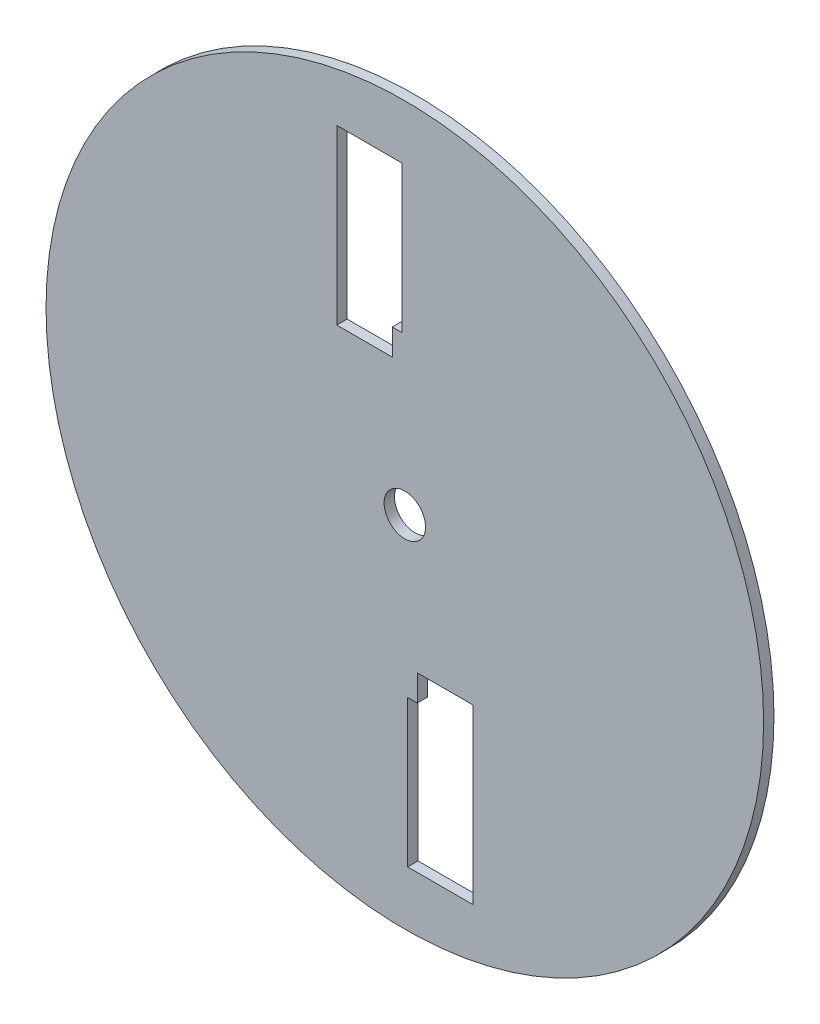
ISO-10303-21;
HEADER;
FILE_DESCRIPTION(('STEP AP214'),'2;1');
FILE_NAME('part.step','',(''),(''),'','','');
FILE_SCHEMA(('AUTOMOTIVE_DESIGN { 1 0 10303 214 1 1 1 1 }'));
ENDSEC;
DATA;
#1=APPLICATION_CONTEXT('core data for automotive mechanical design processes');
#2=APPLICATION_PROTOCOL_DEFINITION('international standard','automotive_design',2000,#1);
#3=PRODUCT_CONTEXT('',#1,'mechanical');
#4=PRODUCT('Part','Part','',(#3));
#5=PRODUCT_RELATED_PRODUCT_CATEGORY('part','',(#4));
#6=PRODUCT_DEFINITION_FORMATION('','',#4);
#7=PRODUCT_DEFINITION_CONTEXT('part definition',#1,'design');
#8=PRODUCT_DEFINITION('design','',#6,#7);
#9=PRODUCT_DEFINITION_SHAPE('','',#8);
#10=(LENGTH_UNIT() NAMED_UNIT(*) SI_UNIT(.MILLI.,.METRE.));
#11=(NAMED_UNIT(*) PLANE_ANGLE_UNIT() SI_UNIT($,.RADIAN.));
#12=(NAMED_UNIT(*) SI_UNIT($,.STERADIAN.) SOLID_ANGLE_UNIT());
#13=UNCERTAINTY_MEASURE_WITH_UNIT(LENGTH_MEASURE(1.E-05),#10,'distance_accuracy_value','');
#14=(GEOMETRIC_REPRESENTATION_CONTEXT(3) GLOBAL_UNCERTAINTY_ASSIGNED_CONTEXT((#13)) GLOBAL_UNIT_ASSIGNED_CONTEXT((#10,
#11,#12)) REPRESENTATION_CONTEXT('',''));
#15=CARTESIAN_POINT('',(0.,0.,0.));
#16=DIRECTION('',(0.,0.,1.));
#17=DIRECTION('',(1.,0.,0.));
#18=AXIS2_PLACEMENT_3D('',#15,#16,#17);
#19=CARTESIAN_POINT('',(0.,-40.,1.5875));
#20=DIRECTION('',(0.,-1.,0.));
#21=DIRECTION('',(0.,0.,-1.));
#22=AXIS2_PLACEMENT_3D('',#19,#20,#21);
#23=PLANE('',#22);
#24=DIRECTION('',(-1.,0.,0.));
#25=VECTOR('',#24,1.);
#26=CARTESIAN_POINT('',(0.,-40.,-1.5875));
#27=LINE('',#26,#25);
#28=CARTESIAN_POINT('',(20.85,-40.,-1.5875));
#29=VERTEX_POINT('',#28);
#30=CARTESIAN_POINT('',(3.85,-40.,-1.5875));
#31=VERTEX_POINT('',#30);
#32=EDGE_CURVE('E185',#29,#31,#27,.T.);
#33=ORIENTED_EDGE('',*,*,#32,.F.);
#34=DIRECTION('',(0.,0.,-1.));
#35=VECTOR('',#34,1.);
#36=CARTESIAN_POINT('',(20.85,-40.,1.5875));
#37=LINE('',#36,#35);
#38=CARTESIAN_POINT('',(20.85,-40.,1.5875));
#39=VERTEX_POINT('',#38);
#40=EDGE_CURVE('E11',#39,#29,#37,.T.);
#41=ORIENTED_EDGE('',*,*,#40,.F.);
#42=DIRECTION('',(-1.,0.,0.));
#43=VECTOR('',#42,1.);
#44=CARTESIAN_POINT('',(0.,-40.,1.5875));
#45=LINE('',#44,#43);
#46=CARTESIAN_POINT('',(3.85,-40.,1.5875));
#47=VERTEX_POINT('',#46);
#48=EDGE_CURVE('E249',#39,#47,#45,.T.);
#49=ORIENTED_EDGE('',*,*,#48,.T.);
#50=DIRECTION('',(0.,0.,-1.));
#51=VECTOR('',#50,1.);
#52=CARTESIAN_POINT('',(3.85,-40.,1.5875));
#53=LINE('',#52,#51);
#54=EDGE_CURVE('E54',#47,#31,#53,.T.);
#55=ORIENTED_EDGE('',*,*,#54,.T.);
#56=EDGE_LOOP('',(#33,#41,#49,#55));
#57=FACE_BOUND('',#56,.T.);
#58=ADVANCED_FACE('F35',(#57),#23,.T.);
#59=CARTESIAN_POINT('',(20.85,0.,1.5875));
#60=DIRECTION('',(-1.,0.,0.));
#61=DIRECTION('',(0.,-1.,0.));
#62=AXIS2_PLACEMENT_3D('',#59,#60,#61);
#63=PLANE('',#62);
#64=DIRECTION('',(0.,1.,0.));
#65=VECTOR('',#64,1.);
#66=CARTESIAN_POINT('',(20.85,0.,-1.5875));
#67=LINE('',#66,#65);
#68=CARTESIAN_POINT('',(20.85,-93.,-1.5875));
#69=VERTEX_POINT('',#68);
#70=EDGE_CURVE('E187',#69,#29,#67,.T.);
#71=ORIENTED_EDGE('',*,*,#70,.F.);
#72=DIRECTION('',(0.,0.,-1.));
#73=VECTOR('',#72,1.);
#74=CARTESIAN_POINT('',(20.85,-93.,1.5875));
#75=LINE('',#74,#73);
#76=CARTESIAN_POINT('',(20.85,-93.,1.5875));
#77=VERTEX_POINT('',#76);
#78=EDGE_CURVE('E45',#77,#69,#75,.T.);
#79=ORIENTED_EDGE('',*,*,#78,.F.);
#80=DIRECTION('',(0.,1.,0.));
#81=VECTOR('',#80,1.);
#82=CARTESIAN_POINT('',(20.85,0.,1.5875));
#83=LINE('',#82,#81);
#84=EDGE_CURVE('E251',#77,#39,#83,.T.);
#85=ORIENTED_EDGE('',*,*,#84,.T.);
#86=ORIENTED_EDGE('',*,*,#40,.T.);
#87=EDGE_LOOP('',(#71,#79,#85,#86));
#88=FACE_BOUND('',#87,.T.);
#89=ADVANCED_FACE('F274',(#88),#63,.T.);
#90=CARTESIAN_POINT('',(0.,-93.,1.5875));
#91=DIRECTION('',(0.,1.,0.));
#92=DIRECTION('',(0.,0.,1.));
#93=AXIS2_PLACEMENT_3D('',#90,#91,#92);
#94=PLANE('',#93);
#95=DIRECTION('',(1.,0.,0.));
#96=VECTOR('',#95,1.);
#97=CARTESIAN_POINT('',(0.,-93.,-1.5875));
#98=LINE('',#97,#96);
#99=CARTESIAN_POINT('',(0.849999999999995,-93.,-1.5875));
#100=VERTEX_POINT('',#99);
#101=EDGE_CURVE('E190',#100,#69,#98,.T.);
#102=ORIENTED_EDGE('',*,*,#101,.F.);
#103=DIRECTION('',(0.,0.,-1.));
#104=VECTOR('',#103,1.);
#105=CARTESIAN_POINT('',(0.849999999999995,-93.,1.5875));
#106=LINE('',#105,#104);
#107=CARTESIAN_POINT('',(0.849999999999995,-93.,1.5875));
#108=VERTEX_POINT('',#107);
#109=EDGE_CURVE('E140',#108,#100,#106,.T.);
#110=ORIENTED_EDGE('',*,*,#109,.F.);
#111=DIRECTION('',(1.,0.,0.));
#112=VECTOR('',#111,1.);
#113=CARTESIAN_POINT('',(0.,-93.,1.5875));
#114=LINE('',#113,#112);
#115=EDGE_CURVE('E152',#108,#77,#114,.T.);
#116=ORIENTED_EDGE('',*,*,#115,.T.);
#117=ORIENTED_EDGE('',*,*,#78,.T.);
#118=EDGE_LOOP('',(#102,#110,#116,#117));
#119=FACE_BOUND('',#118,.T.);
#120=ADVANCED_FACE('F255',(#119),#94,.T.);
#121=CARTESIAN_POINT('',(0.85,0.,1.5875));
#122=DIRECTION('',(1.,0.,0.));
#123=DIRECTION('',(0.,1.,0.));
#124=AXIS2_PLACEMENT_3D('',#121,#122,#123);
#125=PLANE('',#124);
#126=DIRECTION('',(0.,-1.,0.));
#127=VECTOR('',#126,1.);
#128=CARTESIAN_POINT('',(0.85,0.,-1.5875));
#129=LINE('',#128,#127);
#130=CARTESIAN_POINT('',(0.849999999999997,-48.,-1.5875));
#131=VERTEX_POINT('',#130);
#132=EDGE_CURVE('E136',#131,#100,#129,.T.);
#133=ORIENTED_EDGE('',*,*,#132,.F.);
#134=DIRECTION('',(0.,0.,-1.));
#135=VECTOR('',#134,1.);
#136=CARTESIAN_POINT('',(0.849999999999997,-48.,1.5875));
#137=LINE('',#136,#135);
#138=CARTESIAN_POINT('',(0.849999999999997,-48.,1.5875));
#139=VERTEX_POINT('',#138);
#140=EDGE_CURVE('E131',#139,#131,#137,.T.);
#141=ORIENTED_EDGE('',*,*,#140,.F.);
#142=DIRECTION('',(0.,-1.,0.));
#143=VECTOR('',#142,1.);
#144=CARTESIAN_POINT('',(0.85,0.,1.5875));
#145=LINE('',#144,#143);
#146=EDGE_CURVE('E134',#139,#108,#145,.T.);
#147=ORIENTED_EDGE('',*,*,#146,.T.);
#148=ORIENTED_EDGE('',*,*,#109,.T.);
#149=EDGE_LOOP('',(#133,#141,#147,#148));
#150=FACE_BOUND('',#149,.T.);
#151=ADVANCED_FACE('F133',(#150),#125,.T.);
#152=CARTESIAN_POINT('',(0.,-48.,1.5875));
#153=DIRECTION('',(0.,-1.,0.));
#154=DIRECTION('',(0.,0.,-1.));
#155=AXIS2_PLACEMENT_3D('',#152,#153,#154);
#156=PLANE('',#155);
#157=DIRECTION('',(-1.,0.,0.));
#158=VECTOR('',#157,1.);
#159=CARTESIAN_POINT('',(0.,-48.,-1.5875));
#160=LINE('',#159,#158);
#161=CARTESIAN_POINT('',(3.85,-48.,-1.5875));
#162=VERTEX_POINT('',#161);
#163=EDGE_CURVE('E194',#162,#131,#160,.T.);
#164=ORIENTED_EDGE('',*,*,#163,.F.);
#165=DIRECTION('',(0.,0.,-1.));
#166=VECTOR('',#165,1.);
#167=CARTESIAN_POINT('',(3.85,-48.,1.5875));
#168=LINE('',#167,#166);
#169=CARTESIAN_POINT('',(3.85,-48.,1.5875));
#170=VERTEX_POINT('',#169);
#171=EDGE_CURVE('E91',#170,#162,#168,.T.);
#172=ORIENTED_EDGE('',*,*,#171,.F.);
#173=DIRECTION('',(-1.,0.,0.));
#174=VECTOR('',#173,1.);
#175=CARTESIAN_POINT('',(0.,-48.,1.5875));
#176=LINE('',#175,#174);
#177=EDGE_CURVE('E149',#170,#139,#176,.T.);
#178=ORIENTED_EDGE('',*,*,#177,.T.);
#179=ORIENTED_EDGE('',*,*,#140,.T.);
#180=EDGE_LOOP('',(#164,#172,#178,#179));
#181=FACE_BOUND('',#180,.T.);
#182=ADVANCED_FACE('F154',(#181),#156,.T.);
#183=CARTESIAN_POINT('',(-3.85,0.,1.5875));
#184=DIRECTION('',(-1.,0.,0.));
#185=DIRECTION('',(0.,-1.,0.));
#186=AXIS2_PLACEMENT_3D('',#183,#184,#185);
#187=PLANE('',#186);
#188=DIRECTION('',(0.,1.,0.));
#189=VECTOR('',#188,1.);
#190=CARTESIAN_POINT('',(-3.85,0.,-1.5875));
#191=LINE('',#190,#189);
#192=CARTESIAN_POINT('',(-3.85,40.,-1.5875));
#193=VERTEX_POINT('',#192);
#194=CARTESIAN_POINT('',(-3.85,48.,-1.5875));
#195=VERTEX_POINT('',#194);
#196=EDGE_CURVE('E167',#193,#195,#191,.T.);
#197=ORIENTED_EDGE('',*,*,#196,.F.);
#198=DIRECTION('',(0.,0.,-1.));
#199=VECTOR('',#198,1.);
#200=CARTESIAN_POINT('',(-3.85,40.,1.5875));
#201=LINE('',#200,#199);
#202=CARTESIAN_POINT('',(-3.85,40.,1.5875));
#203=VERTEX_POINT('',#202);
#204=EDGE_CURVE('E39',#203,#193,#201,.T.);
#205=ORIENTED_EDGE('',*,*,#204,.F.);
#206=DIRECTION('',(0.,1.,0.));
#207=VECTOR('',#206,1.);
#208=CARTESIAN_POINT('',(-3.85,0.,1.5875));
#209=LINE('',#208,#207);
#210=CARTESIAN_POINT('',(-3.85,48.,1.5875));
#211=VERTEX_POINT('',#210);
#212=EDGE_CURVE('E392',#203,#211,#209,.T.);
#213=ORIENTED_EDGE('',*,*,#212,.T.);
#214=DIRECTION('',(0.,0.,-1.));
#215=VECTOR('',#214,1.);
#216=CARTESIAN_POINT('',(-3.85,48.,1.5875));
#217=LINE('',#216,#215);
#218=EDGE_CURVE('E163',#211,#195,#217,.T.);
#219=ORIENTED_EDGE('',*,*,#218,.T.);
#220=EDGE_LOOP('',(#197,#205,#213,#219));
#221=FACE_BOUND('',#220,.T.);
#222=ADVANCED_FACE('F223',(#221),#187,.T.);
#223=CARTESIAN_POINT('',(0.,40.,1.5875));
#224=DIRECTION('',(0.,1.,0.));
#225=DIRECTION('',(0.,0.,1.));
#226=AXIS2_PLACEMENT_3D('',#223,#224,#225);
#227=PLANE('',#226);
#228=DIRECTION('',(1.,0.,0.));
#229=VECTOR('',#228,1.);
#230=CARTESIAN_POINT('',(0.,40.,-1.5875));
#231=LINE('',#230,#229);
#232=CARTESIAN_POINT('',(-20.85,40.,-1.5875));
#233=VERTEX_POINT('',#232);
#234=EDGE_CURVE('E170',#233,#193,#231,.T.);
#235=ORIENTED_EDGE('',*,*,#234,.F.);
#236=DIRECTION('',(0.,0.,-1.));
#237=VECTOR('',#236,1.);
#238=CARTESIAN_POINT('',(-20.85,40.,1.5875));
#239=LINE('',#238,#237);
#240=CARTESIAN_POINT('',(-20.85,40.,1.5875));
#241=VERTEX_POINT('',#240);
#242=EDGE_CURVE('E213',#241,#233,#239,.T.);
#243=ORIENTED_EDGE('',*,*,#242,.F.);
#244=DIRECTION('',(1.,0.,0.));
#245=VECTOR('',#244,1.);
#246=CARTESIAN_POINT('',(0.,40.,1.5875));
#247=LINE('',#246,#245);
#248=EDGE_CURVE('E222',#241,#203,#247,.T.);
#249=ORIENTED_EDGE('',*,*,#248,.T.);
#250=ORIENTED_EDGE('',*,*,#204,.T.);
#251=EDGE_LOOP('',(#235,#243,#249,#250));
#252=FACE_BOUND('',#251,.T.);
#253=ADVANCED_FACE('F220',(#252),#227,.T.);
#254=CARTESIAN_POINT('',(-20.85,0.,1.5875));
#255=DIRECTION('',(1.,0.,0.));
#256=DIRECTION('',(0.,1.,0.));
#257=AXIS2_PLACEMENT_3D('',#254,#255,#256);
#258=PLANE('',#257);
#259=DIRECTION('',(0.,-1.,0.));
#260=VECTOR('',#259,1.);
#261=CARTESIAN_POINT('',(-20.85,0.,-1.5875));
#262=LINE('',#261,#260);
#263=CARTESIAN_POINT('',(-20.85,93.,-1.5875));
#264=VERTEX_POINT('',#263);
#265=EDGE_CURVE('E173',#264,#233,#262,.T.);
#266=ORIENTED_EDGE('',*,*,#265,.F.);
#267=DIRECTION('',(0.,0.,-1.));
#268=VECTOR('',#267,1.);
#269=CARTESIAN_POINT('',(-20.85,93.,1.5875));
#270=LINE('',#269,#268);
#271=CARTESIAN_POINT('',(-20.85,93.,1.5875));
#272=VERTEX_POINT('',#271);
#273=EDGE_CURVE('E212',#272,#264,#270,.T.);
#274=ORIENTED_EDGE('',*,*,#273,.F.);
#275=DIRECTION('',(0.,-1.,0.));
#276=VECTOR('',#275,1.);
#277=CARTESIAN_POINT('',(-20.85,0.,1.5875));
#278=LINE('',#277,#276);
#279=EDGE_CURVE('E231',#272,#241,#278,.T.);
#280=ORIENTED_EDGE('',*,*,#279,.T.);
#281=ORIENTED_EDGE('',*,*,#242,.T.);
#282=EDGE_LOOP('',(#266,#274,#280,#281));
#283=FACE_BOUND('',#282,.T.);
#284=ADVANCED_FACE('F229',(#283),#258,.T.);
#285=CARTESIAN_POINT('',(0.,93.,1.5875));
#286=DIRECTION('',(0.,-1.,0.));
#287=DIRECTION('',(0.,0.,-1.));
#288=AXIS2_PLACEMENT_3D('',#285,#286,#287);
#289=PLANE('',#288);
#290=DIRECTION('',(-1.,0.,0.));
#291=VECTOR('',#290,1.);
#292=CARTESIAN_POINT('',(0.,93.,-1.5875));
#293=LINE('',#292,#291);
#294=CARTESIAN_POINT('',(-0.850000000000011,93.,-1.5875));
#295=VERTEX_POINT('',#294);
#296=EDGE_CURVE('E176',#295,#264,#293,.T.);
#297=ORIENTED_EDGE('',*,*,#296,.F.);
#298=DIRECTION('',(0.,0.,-1.));
#299=VECTOR('',#298,1.);
#300=CARTESIAN_POINT('',(-0.850000000000011,93.,1.5875));
#301=LINE('',#300,#299);
#302=CARTESIAN_POINT('',(-0.850000000000011,93.,1.5875));
#303=VERTEX_POINT('',#302);
#304=EDGE_CURVE('E210',#303,#295,#301,.T.);
#305=ORIENTED_EDGE('',*,*,#304,.F.);
#306=DIRECTION('',(-1.,0.,0.));
#307=VECTOR('',#306,1.);
#308=CARTESIAN_POINT('',(0.,93.,1.5875));
#309=LINE('',#308,#307);
#310=EDGE_CURVE('E237',#303,#272,#309,.T.);
#311=ORIENTED_EDGE('',*,*,#310,.T.);
#312=ORIENTED_EDGE('',*,*,#273,.T.);
#313=EDGE_LOOP('',(#297,#305,#311,#312));
#314=FACE_BOUND('',#313,.T.);
#315=ADVANCED_FACE('F240',(#314),#289,.T.);
#316=CARTESIAN_POINT('',(-0.849999999999994,0.,1.5875));
#317=DIRECTION('',(-1.,0.,0.));
#318=DIRECTION('',(0.,-1.,0.));
#319=AXIS2_PLACEMENT_3D('',#316,#317,#318);
#320=PLANE('',#319);
#321=DIRECTION('',(0.,1.,0.));
#322=VECTOR('',#321,1.);
#323=CARTESIAN_POINT('',(-0.849999999999994,0.,-1.5875));
#324=LINE('',#323,#322);
#325=CARTESIAN_POINT('',(-0.850000000000003,48.,-1.5875));
#326=VERTEX_POINT('',#325);
#327=EDGE_CURVE('E179',#326,#295,#324,.T.);
#328=ORIENTED_EDGE('',*,*,#327,.F.);
#329=DIRECTION('',(0.,0.,-1.));
#330=VECTOR('',#329,1.);
#331=CARTESIAN_POINT('',(-0.850000000000003,48.,1.5875));
#332=LINE('',#331,#330);
#333=CARTESIAN_POINT('',(-0.850000000000003,48.,1.5875));
#334=VERTEX_POINT('',#333);
#335=EDGE_CURVE('E208',#334,#326,#332,.T.);
#336=ORIENTED_EDGE('',*,*,#335,.F.);
#337=DIRECTION('',(0.,1.,0.));
#338=VECTOR('',#337,1.);
#339=CARTESIAN_POINT('',(-0.849999999999994,0.,1.5875));
#340=LINE('',#339,#338);
#341=EDGE_CURVE('E241',#334,#303,#340,.T.);
#342=ORIENTED_EDGE('',*,*,#341,.T.);
#343=ORIENTED_EDGE('',*,*,#304,.T.);
#344=EDGE_LOOP('',(#328,#336,#342,#343));
#345=FACE_BOUND('',#344,.T.);
#346=ADVANCED_FACE('F261',(#345),#320,.T.);
#347=CARTESIAN_POINT('',(3.85000000000002,0.,1.5875));
#348=DIRECTION('',(1.,0.,0.));
#349=DIRECTION('',(0.,1.,0.));
#350=AXIS2_PLACEMENT_3D('',#347,#348,#349);
#351=PLANE('',#350);
#352=DIRECTION('',(0.,-1.,0.));
#353=VECTOR('',#352,1.);
#354=CARTESIAN_POINT('',(3.85000000000002,0.,-1.5875));
#355=LINE('',#354,#353);
#356=EDGE_CURVE('E196',#31,#162,#355,.T.);
#357=ORIENTED_EDGE('',*,*,#356,.F.);
#358=ORIENTED_EDGE('',*,*,#54,.F.);
#359=DIRECTION('',(0.,-1.,0.));
#360=VECTOR('',#359,1.);
#361=CARTESIAN_POINT('',(3.85000000000002,0.,1.5875));
#362=LINE('',#361,#360);
#363=EDGE_CURVE('E155',#47,#170,#362,.T.);
#364=ORIENTED_EDGE('',*,*,#363,.T.);
#365=ORIENTED_EDGE('',*,*,#171,.T.);
#366=EDGE_LOOP('',(#357,#358,#364,#365));
#367=FACE_BOUND('',#366,.T.);
#368=ADVANCED_FACE('F258',(#367),#351,.T.);
#369=CARTESIAN_POINT('',(0.,48.,1.5875));
#370=DIRECTION('',(0.,1.,0.));
#371=DIRECTION('',(0.,0.,1.));
#372=AXIS2_PLACEMENT_3D('',#369,#370,#371);
#373=PLANE('',#372);
#374=DIRECTION('',(1.,0.,0.));
#375=VECTOR('',#374,1.);
#376=CARTESIAN_POINT('',(0.,48.,-1.5875));
#377=LINE('',#376,#375);
#378=EDGE_CURVE('E182',#195,#326,#377,.T.);
#379=ORIENTED_EDGE('',*,*,#378,.F.);
#380=ORIENTED_EDGE('',*,*,#218,.F.);
#381=DIRECTION('',(1.,0.,0.));
#382=VECTOR('',#381,1.);
#383=CARTESIAN_POINT('',(0.,48.,1.5875));
#384=LINE('',#383,#382);
#385=EDGE_CURVE('E243',#211,#334,#384,.T.);
#386=ORIENTED_EDGE('',*,*,#385,.T.);
#387=ORIENTED_EDGE('',*,*,#335,.T.);
#388=EDGE_LOOP('',(#379,#380,#386,#387));
#389=FACE_BOUND('',#388,.T.);
#390=ADVANCED_FACE('F260',(#389),#373,.T.);
#391=CARTESIAN_POINT('',(0.,0.,1.5875));
#392=DIRECTION('',(0.,0.,-1.));
#393=DIRECTION('',(-1.,0.,0.));
#394=AXIS2_PLACEMENT_3D('',#391,#392,#393);
#395=CYLINDRICAL_SURFACE('',#394,6.35);
#396=CARTESIAN_POINT('',(0.,0.,1.5875));
#397=DIRECTION('',(0.,0.,1.));
#398=DIRECTION('',(1.,0.,0.));
#399=AXIS2_PLACEMENT_3D('',#396,#397,#398);
#400=CIRCLE('',#399,6.35);
#401=CARTESIAN_POINT('',(6.35,0.,1.5875));
#402=VERTEX_POINT('',#401);
#403=EDGE_CURVE('E202',#402,#402,#400,.T.);
#404=ORIENTED_EDGE('',*,*,#403,.T.);
#405=EDGE_LOOP('',(#404));
#406=FACE_BOUND('',#405,.T.);
#407=CARTESIAN_POINT('',(0.,0.,-1.5875));
#408=DIRECTION('',(0.,0.,1.));
#409=DIRECTION('',(1.,0.,0.));
#410=AXIS2_PLACEMENT_3D('',#407,#408,#409);
#411=CIRCLE('',#410,6.35);
#412=CARTESIAN_POINT('',(6.35,0.,-1.5875));
#413=VERTEX_POINT('',#412);
#414=EDGE_CURVE('E164',#413,#413,#411,.T.);
#415=ORIENTED_EDGE('',*,*,#414,.F.);
#416=EDGE_LOOP('',(#415));
#417=FACE_BOUND('',#416,.T.);
#418=ADVANCED_FACE('F37',(#406,#417),#395,.F.);
#419=CARTESIAN_POINT('',(0.,0.,1.5875));
#420=DIRECTION('',(0.,0.,-1.));
#421=DIRECTION('',(-1.,0.,0.));
#422=AXIS2_PLACEMENT_3D('',#419,#420,#421);
#423=CYLINDRICAL_SURFACE('',#422,110.);
#424=CARTESIAN_POINT('',(0.,0.,1.5875));
#425=DIRECTION('',(0.,0.,1.));
#426=DIRECTION('',(1.,0.,0.));
#427=AXIS2_PLACEMENT_3D('',#424,#425,#426);
#428=CIRCLE('',#427,110.);
#429=CARTESIAN_POINT('',(110.,0.,1.5875));
#430=VERTEX_POINT('',#429);
#431=EDGE_CURVE('E157',#430,#430,#428,.T.);
#432=ORIENTED_EDGE('',*,*,#431,.F.);
#433=EDGE_LOOP('',(#432));
#434=FACE_BOUND('',#433,.T.);
#435=CARTESIAN_POINT('',(0.,0.,-1.5875));
#436=DIRECTION('',(0.,0.,1.));
#437=DIRECTION('',(1.,0.,0.));
#438=AXIS2_PLACEMENT_3D('',#435,#436,#437);
#439=CIRCLE('',#438,110.);
#440=CARTESIAN_POINT('',(110.,0.,-1.5875));
#441=VERTEX_POINT('',#440);
#442=EDGE_CURVE('E199',#441,#441,#439,.T.);
#443=ORIENTED_EDGE('',*,*,#442,.T.);
#444=EDGE_LOOP('',(#443));
#445=FACE_BOUND('',#444,.T.);
#446=ADVANCED_FACE('F358',(#434,#445),#423,.T.);
#447=CARTESIAN_POINT('',(0.,0.,1.5875));
#448=DIRECTION('',(0.,0.,1.));
#449=DIRECTION('',(1.,0.,0.));
#450=AXIS2_PLACEMENT_3D('',#447,#448,#449);
#451=PLANE('',#450);
#452=ORIENTED_EDGE('',*,*,#403,.F.);
#453=EDGE_LOOP('',(#452));
#454=FACE_BOUND('',#453,.T.);
#455=ORIENTED_EDGE('',*,*,#212,.F.);
#456=ORIENTED_EDGE('',*,*,#248,.F.);
#457=ORIENTED_EDGE('',*,*,#279,.F.);
#458=ORIENTED_EDGE('',*,*,#310,.F.);
#459=ORIENTED_EDGE('',*,*,#341,.F.);
#460=ORIENTED_EDGE('',*,*,#385,.F.);
#461=EDGE_LOOP('',(#455,#456,#457,#458,#459,#460));
#462=FACE_BOUND('',#461,.T.);
#463=ORIENTED_EDGE('',*,*,#48,.F.);
#464=ORIENTED_EDGE('',*,*,#84,.F.);
#465=ORIENTED_EDGE('',*,*,#115,.F.);
#466=ORIENTED_EDGE('',*,*,#146,.F.);
#467=ORIENTED_EDGE('',*,*,#177,.F.);
#468=ORIENTED_EDGE('',*,*,#363,.F.);
#469=EDGE_LOOP('',(#463,#464,#465,#466,#467,#468));
#470=FACE_BOUND('',#469,.T.);
#471=ORIENTED_EDGE('',*,*,#431,.T.);
#472=EDGE_LOOP('',(#471));
#473=FACE_BOUND('',#472,.T.);
#474=ADVANCED_FACE('F146',(#454,#462,#470,#473),#451,.T.);
#475=CARTESIAN_POINT('',(0.,0.,-1.5875));
#476=DIRECTION('',(0.,0.,1.));
#477=DIRECTION('',(1.,0.,0.));
#478=AXIS2_PLACEMENT_3D('',#475,#476,#477);
#479=PLANE('',#478);
#480=ORIENTED_EDGE('',*,*,#414,.T.);
#481=EDGE_LOOP('',(#480));
#482=FACE_BOUND('',#481,.T.);
#483=ORIENTED_EDGE('',*,*,#196,.T.);
#484=ORIENTED_EDGE('',*,*,#378,.T.);
#485=ORIENTED_EDGE('',*,*,#327,.T.);
#486=ORIENTED_EDGE('',*,*,#296,.T.);
#487=ORIENTED_EDGE('',*,*,#265,.T.);
#488=ORIENTED_EDGE('',*,*,#234,.T.);
#489=EDGE_LOOP('',(#483,#484,#485,#486,#487,#488));
#490=FACE_BOUND('',#489,.T.);
#491=ORIENTED_EDGE('',*,*,#32,.T.);
#492=ORIENTED_EDGE('',*,*,#356,.T.);
#493=ORIENTED_EDGE('',*,*,#163,.T.);
#494=ORIENTED_EDGE('',*,*,#132,.T.);
#495=ORIENTED_EDGE('',*,*,#101,.T.);
#496=ORIENTED_EDGE('',*,*,#70,.T.);
#497=EDGE_LOOP('',(#491,#492,#493,#494,#495,#496));
#498=FACE_BOUND('',#497,.T.);
#499=ORIENTED_EDGE('',*,*,#442,.F.);
#500=EDGE_LOOP('',(#499));
#501=FACE_BOUND('',#500,.T.);
#502=ADVANCED_FACE('F226',(#482,#490,#498,#501),#479,.F.);
#503=CLOSED_SHELL('',(#58,#89,#120,#151,#182,#222,#253,#284,#315,#346,#368,#390,#418,#446,#474,#502));
#504=MANIFOLD_SOLID_BREP('B2',#503);
#505=ADVANCED_BREP_SHAPE_REPRESENTATION('',(#18,#504),#14);
#506=SHAPE_DEFINITION_REPRESENTATION(#9,#505);
ENDSEC;
END-ISO-10303-21;
